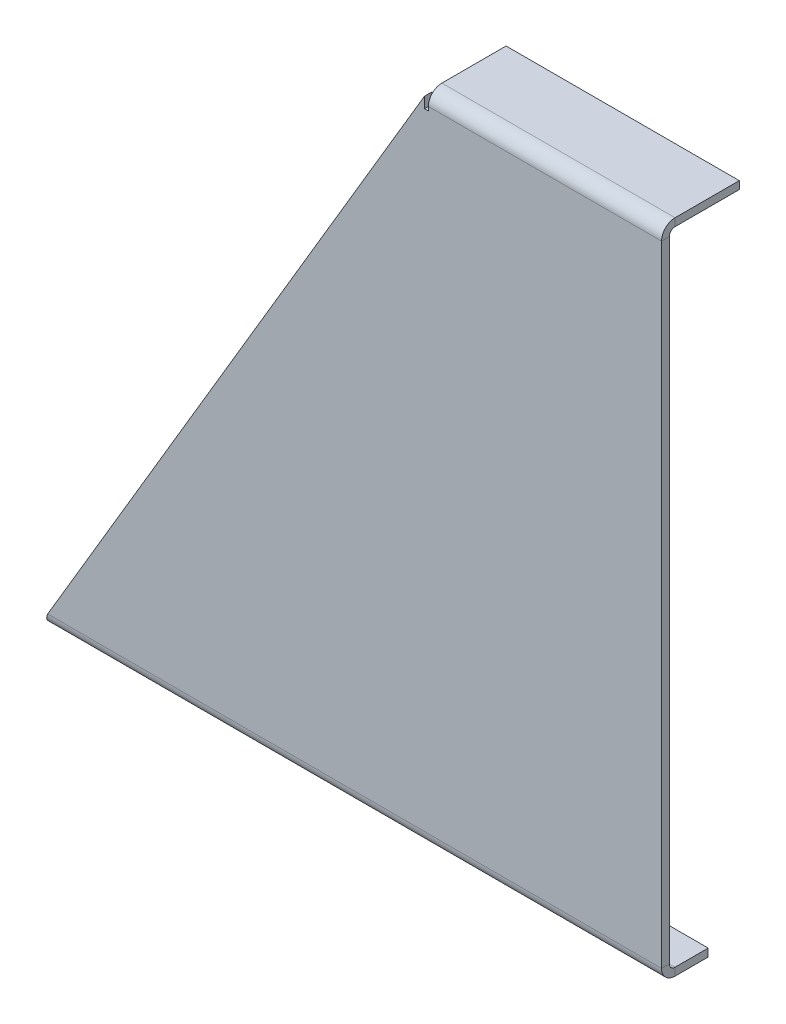
ISO-10303-21;
HEADER;
FILE_DESCRIPTION(('STEP AP214'),'2;1');
FILE_NAME('part.step','',(''),(''),'','','');
FILE_SCHEMA(('AUTOMOTIVE_DESIGN { 1 0 10303 214 1 1 1 1 }'));
ENDSEC;
DATA;
#1=APPLICATION_CONTEXT('core data for automotive mechanical design processes');
#2=APPLICATION_PROTOCOL_DEFINITION('international standard','automotive_design',2000,#1);
#3=PRODUCT_CONTEXT('',#1,'mechanical');
#4=PRODUCT('Part','Part','',(#3));
#5=PRODUCT_RELATED_PRODUCT_CATEGORY('part','',(#4));
#6=PRODUCT_DEFINITION_FORMATION('','',#4);
#7=PRODUCT_DEFINITION_CONTEXT('part definition',#1,'design');
#8=PRODUCT_DEFINITION('design','',#6,#7);
#9=PRODUCT_DEFINITION_SHAPE('','',#8);
#10=(LENGTH_UNIT() NAMED_UNIT(*) SI_UNIT(.MILLI.,.METRE.));
#11=(NAMED_UNIT(*) PLANE_ANGLE_UNIT() SI_UNIT($,.RADIAN.));
#12=(NAMED_UNIT(*) SI_UNIT($,.STERADIAN.) SOLID_ANGLE_UNIT());
#13=UNCERTAINTY_MEASURE_WITH_UNIT(LENGTH_MEASURE(1.E-05),#10,'distance_accuracy_value','');
#14=(GEOMETRIC_REPRESENTATION_CONTEXT(3) GLOBAL_UNCERTAINTY_ASSIGNED_CONTEXT((#13)) GLOBAL_UNIT_ASSIGNED_CONTEXT((#10,
#11,#12)) REPRESENTATION_CONTEXT('',''));
#15=CARTESIAN_POINT('',(0.,0.,0.));
#16=DIRECTION('',(0.,0.,1.));
#17=DIRECTION('',(1.,0.,0.));
#18=AXIS2_PLACEMENT_3D('',#15,#16,#17);
#19=CARTESIAN_POINT('',(-30.,84.5,-1.));
#20=DIRECTION('',(-0.860622231738049,0.509243924105354,0.));
#21=DIRECTION('',(-0.509243924105354,-0.860622231738049,0.));
#22=AXIS2_PLACEMENT_3D('',#19,#20,#21);
#23=PLANE('',#22);
#24=DIRECTION('',(-0.509243924105354,-0.860622231738049,0.));
#25=VECTOR('',#24,1.);
#26=CARTESIAN_POINT('',(-30.,84.5,0.));
#27=LINE('',#26,#25);
#28=CARTESIAN_POINT('',(-30.5,83.655,0.));
#29=VERTEX_POINT('',#28);
#30=CARTESIAN_POINT('',(-78.972426035503,1.7366,0.));
#31=VERTEX_POINT('',#30);
#32=EDGE_CURVE('E105',#29,#31,#27,.T.);
#33=ORIENTED_EDGE('',*,*,#32,.F.);
#34=DIRECTION('',(0.,0.,1.));
#35=VECTOR('',#34,1.);
#36=CARTESIAN_POINT('',(-30.5,83.655,-1.));
#37=LINE('',#36,#35);
#38=CARTESIAN_POINT('',(-30.5,83.655,-1.));
#39=VERTEX_POINT('',#38);
#40=EDGE_CURVE('E277',#39,#29,#37,.T.);
#41=ORIENTED_EDGE('',*,*,#40,.F.);
#42=DIRECTION('',(-0.509243924105354,-0.860622231738049,0.));
#43=VECTOR('',#42,1.);
#44=CARTESIAN_POINT('',(-30.,84.5,-1.));
#45=LINE('',#44,#43);
#46=CARTESIAN_POINT('',(-78.972426035503,1.7366,-1.));
#47=VERTEX_POINT('',#46);
#48=EDGE_CURVE('E120',#39,#47,#45,.T.);
#49=ORIENTED_EDGE('',*,*,#48,.T.);
#50=DIRECTION('',(0.,0.,1.));
#51=VECTOR('',#50,1.);
#52=CARTESIAN_POINT('',(-78.972426035503,1.7366,-1.));
#53=LINE('',#52,#51);
#54=EDGE_CURVE('E314',#47,#31,#53,.T.);
#55=ORIENTED_EDGE('',*,*,#54,.T.);
#56=EDGE_LOOP('',(#33,#41,#49,#55));
#57=FACE_BOUND('',#56,.T.);
#58=ADVANCED_FACE('F81',(#57),#23,.T.);
#59=CARTESIAN_POINT('',(0.,0.,-1.));
#60=DIRECTION('',(0.,0.,1.));
#61=DIRECTION('',(1.,0.,0.));
#62=AXIS2_PLACEMENT_3D('',#59,#60,#61);
#63=PLANE('',#62);
#64=DIRECTION('',(1.,0.,0.));
#65=VECTOR('',#64,1.);
#66=CARTESIAN_POINT('',(0.,82.7634,-1.));
#67=LINE('',#66,#65);
#68=CARTESIAN_POINT('',(0.,82.7634,-1.));
#69=VERTEX_POINT('',#68);
#70=CARTESIAN_POINT('',(-30.,82.7634,-1.));
#71=VERTEX_POINT('',#70);
#72=EDGE_CURVE('E256',#69,#71,#67,.F.);
#73=ORIENTED_EDGE('',*,*,#72,.F.);
#74=DIRECTION('',(0.,1.,0.));
#75=VECTOR('',#74,1.);
#76=CARTESIAN_POINT('',(0.,0.,-1.));
#77=LINE('',#76,#75);
#78=CARTESIAN_POINT('',(0.,1.7366,-1.));
#79=VERTEX_POINT('',#78);
#80=EDGE_CURVE('E379',#79,#69,#77,.T.);
#81=ORIENTED_EDGE('',*,*,#80,.F.);
#82=DIRECTION('',(-1.,0.,0.));
#83=VECTOR('',#82,1.);
#84=CARTESIAN_POINT('',(-80.,1.7366,-1.));
#85=LINE('',#84,#83);
#86=EDGE_CURVE('E127',#47,#79,#85,.F.);
#87=ORIENTED_EDGE('',*,*,#86,.F.);
#88=ORIENTED_EDGE('',*,*,#48,.F.);
#89=DIRECTION('',(0.,1.,0.));
#90=VECTOR('',#89,1.);
#91=CARTESIAN_POINT('',(-30.5,82.2634,-1.));
#92=LINE('',#91,#90);
#93=CARTESIAN_POINT('',(-30.5,82.2634,-1.));
#94=VERTEX_POINT('',#93);
#95=EDGE_CURVE('E275',#94,#39,#92,.T.);
#96=ORIENTED_EDGE('',*,*,#95,.F.);
#97=DIRECTION('',(-1.,0.,0.));
#98=VECTOR('',#97,1.);
#99=CARTESIAN_POINT('',(-30.,82.2634,-1.));
#100=LINE('',#99,#98);
#101=CARTESIAN_POINT('',(-30.,82.2634,-1.));
#102=VERTEX_POINT('',#101);
#103=EDGE_CURVE('E271',#102,#94,#100,.T.);
#104=ORIENTED_EDGE('',*,*,#103,.F.);
#105=DIRECTION('',(0.,-1.,0.));
#106=VECTOR('',#105,1.);
#107=CARTESIAN_POINT('',(-30.,82.7634,-1.));
#108=LINE('',#107,#106);
#109=EDGE_CURVE('E267',#71,#102,#108,.T.);
#110=ORIENTED_EDGE('',*,*,#109,.F.);
#111=EDGE_LOOP('',(#73,#81,#87,#88,#96,#104,#110));
#112=FACE_BOUND('',#111,.T.);
#113=ADVANCED_FACE('F366',(#112),#63,.F.);
#114=CARTESIAN_POINT('',(0.,0.,0.));
#115=DIRECTION('',(0.,0.,1.));
#116=DIRECTION('',(1.,0.,0.));
#117=AXIS2_PLACEMENT_3D('',#114,#115,#116);
#118=PLANE('',#117);
#119=DIRECTION('',(0.,1.,0.));
#120=VECTOR('',#119,1.);
#121=CARTESIAN_POINT('',(0.,0.,0.));
#122=LINE('',#121,#120);
#123=CARTESIAN_POINT('',(0.,1.7366,0.));
#124=VERTEX_POINT('',#123);
#125=CARTESIAN_POINT('',(0.,82.7634,0.));
#126=VERTEX_POINT('',#125);
#127=EDGE_CURVE('E323',#124,#126,#122,.T.);
#128=ORIENTED_EDGE('',*,*,#127,.T.);
#129=DIRECTION('',(1.,0.,0.));
#130=VECTOR('',#129,1.);
#131=CARTESIAN_POINT('',(0.,82.7634,0.));
#132=LINE('',#131,#130);
#133=CARTESIAN_POINT('',(-30.,82.7634,0.));
#134=VERTEX_POINT('',#133);
#135=EDGE_CURVE('E243',#126,#134,#132,.F.);
#136=ORIENTED_EDGE('',*,*,#135,.T.);
#137=DIRECTION('',(0.,-1.,0.));
#138=VECTOR('',#137,1.);
#139=CARTESIAN_POINT('',(-30.,0.,0.));
#140=LINE('',#139,#138);
#141=CARTESIAN_POINT('',(-30.,82.2634,0.));
#142=VERTEX_POINT('',#141);
#143=EDGE_CURVE('E13',#134,#142,#140,.T.);
#144=ORIENTED_EDGE('',*,*,#143,.T.);
#145=DIRECTION('',(-1.,0.,0.));
#146=VECTOR('',#145,1.);
#147=CARTESIAN_POINT('',(0.,82.2634,0.));
#148=LINE('',#147,#146);
#149=CARTESIAN_POINT('',(-30.5,82.2634,0.));
#150=VERTEX_POINT('',#149);
#151=EDGE_CURVE('E89',#142,#150,#148,.T.);
#152=ORIENTED_EDGE('',*,*,#151,.T.);
#153=DIRECTION('',(0.,1.,0.));
#154=VECTOR('',#153,1.);
#155=CARTESIAN_POINT('',(-30.5,0.,0.));
#156=LINE('',#155,#154);
#157=EDGE_CURVE('E383',#150,#29,#156,.T.);
#158=ORIENTED_EDGE('',*,*,#157,.T.);
#159=ORIENTED_EDGE('',*,*,#32,.T.);
#160=DIRECTION('',(-1.,0.,0.));
#161=VECTOR('',#160,1.);
#162=CARTESIAN_POINT('',(-80.,1.7366,0.));
#163=LINE('',#162,#161);
#164=EDGE_CURVE('E315',#31,#124,#163,.F.);
#165=ORIENTED_EDGE('',*,*,#164,.T.);
#166=EDGE_LOOP('',(#128,#136,#144,#152,#158,#159,#165));
#167=FACE_BOUND('',#166,.T.);
#168=ADVANCED_FACE('F362',(#167),#118,.T.);
#169=CARTESIAN_POINT('',(0.,0.,-1.));
#170=DIRECTION('',(1.,0.,0.));
#171=DIRECTION('',(0.,0.,-1.));
#172=AXIS2_PLACEMENT_3D('',#169,#170,#171);
#173=PLANE('',#172);
#174=ORIENTED_EDGE('',*,*,#80,.T.);
#175=DIRECTION('',(0.,0.,1.));
#176=VECTOR('',#175,1.);
#177=CARTESIAN_POINT('',(0.,82.7634,-1.));
#178=LINE('',#177,#176);
#179=EDGE_CURVE('E250',#69,#126,#178,.T.);
#180=ORIENTED_EDGE('',*,*,#179,.T.);
#181=ORIENTED_EDGE('',*,*,#127,.F.);
#182=DIRECTION('',(0.,0.,1.));
#183=VECTOR('',#182,1.);
#184=CARTESIAN_POINT('',(0.,1.7366,-1.));
#185=LINE('',#184,#183);
#186=EDGE_CURVE('E321',#79,#124,#185,.T.);
#187=ORIENTED_EDGE('',*,*,#186,.F.);
#188=EDGE_LOOP('',(#174,#180,#181,#187));
#189=FACE_BOUND('',#188,.T.);
#190=ADVANCED_FACE('F83',(#189),#173,.T.);
#191=CARTESIAN_POINT('',(0.,1.7366,-1.7366));
#192=DIRECTION('',(1.,0.,0.));
#193=DIRECTION('',(0.,0.,-1.));
#194=AXIS2_PLACEMENT_3D('',#191,#192,#193);
#195=PLANE('',#194);
#196=DIRECTION('',(0.,1.,0.));
#197=VECTOR('',#196,1.);
#198=CARTESIAN_POINT('',(0.,0.,-1.73659999999999));
#199=LINE('',#198,#197);
#200=CARTESIAN_POINT('',(0.,0.999999999999997,-1.7366));
#201=VERTEX_POINT('',#200);
#202=CARTESIAN_POINT('',(0.,0.,-1.73659999999999));
#203=VERTEX_POINT('',#202);
#204=EDGE_CURVE('E270',#201,#203,#199,.F.);
#205=ORIENTED_EDGE('',*,*,#204,.F.);
#206=CARTESIAN_POINT('',(0.,1.7366,-1.7366));
#207=DIRECTION('',(-1.,0.,0.));
#208=DIRECTION('',(0.,0.,1.));
#209=AXIS2_PLACEMENT_3D('',#206,#207,#208);
#210=CIRCLE('',#209,0.736599999999998);
#211=EDGE_CURVE('E316',#79,#201,#210,.F.);
#212=ORIENTED_EDGE('',*,*,#211,.F.);
#213=ORIENTED_EDGE('',*,*,#186,.T.);
#214=CARTESIAN_POINT('',(0.,1.7366,-1.7366));
#215=DIRECTION('',(-1.,0.,0.));
#216=DIRECTION('',(0.,0.,1.));
#217=AXIS2_PLACEMENT_3D('',#214,#215,#216);
#218=CIRCLE('',#217,1.7366);
#219=EDGE_CURVE('E96',#124,#203,#218,.F.);
#220=ORIENTED_EDGE('',*,*,#219,.T.);
#221=EDGE_LOOP('',(#205,#212,#213,#220));
#222=FACE_BOUND('',#221,.T.);
#223=ADVANCED_FACE('F354',(#222),#195,.T.);
#224=CARTESIAN_POINT('',(-80.,-0.0100000000000026,-1.73659999999999));
#225=CARTESIAN_POINT('',(-79.9143552669118,-0.0100000000000018,-1.50793444079452));
#226=CARTESIAN_POINT('',(-79.8287376725838,0.0354593229311186,-1.27943114517808));
#227=CARTESIAN_POINT('',(-79.6574753451677,0.210444694100452,-0.856979088884184));
#228=CARTESIAN_POINT('',(-79.5718441814596,0.339901893067338,-0.663232698891812));
#229=CARTESIAN_POINT('',(-79.4005818540434,0.663232698891812,-0.339901893067339));
#230=CARTESIAN_POINT('',(-79.3149506903353,0.856979088884186,-0.210444694100454));
#231=CARTESIAN_POINT('',(-79.1436883629191,1.27943114517808,-0.0354593229311214));
#232=CARTESIAN_POINT('',(-79.0580707685912,1.50793444079454,0.00999999999999834));
#233=CARTESIAN_POINT('',(-78.972426035503,1.7366,0.00999999999999827));
#234=CARTESIAN_POINT('',(-80.,0.,-1.73659999999999));
#235=CARTESIAN_POINT('',(-79.9143553158032,0.,-1.50924369946561));
#236=CARTESIAN_POINT('',(-79.8287376725838,0.0451990496978017,-1.28204862402167));
#237=CARTESIAN_POINT('',(-79.6574753451677,0.219182557983995,-0.862015278687893));
#238=CARTESIAN_POINT('',(-79.5718441814596,0.34789856149132,-0.669378166091561));
#239=CARTESIAN_POINT('',(-79.4005818540434,0.669378166091562,-0.34789856149132));
#240=CARTESIAN_POINT('',(-79.3149506903353,0.862015278687895,-0.219182557983996));
#241=CARTESIAN_POINT('',(-79.1436883629191,1.28204862402167,-0.0451990496978045));
#242=CARTESIAN_POINT('',(-79.0580707196997,1.50924369946562,0.));
#243=CARTESIAN_POINT('',(-78.972426035503,1.7366,0.));
#244=CARTESIAN_POINT('',(-80.,0.999999999999997,-1.7366));
#245=CARTESIAN_POINT('',(-79.9143602049447,0.999999999999998,-1.64016956657421));
#246=CARTESIAN_POINT('',(-79.8287376725838,1.01917172636612,-1.54379650838095));
#247=CARTESIAN_POINT('',(-79.6574753451677,1.09296894633825,-1.36563425905879));
#248=CARTESIAN_POINT('',(-79.5718441814596,1.1475654038895,-1.28392488606648));
#249=CARTESIAN_POINT('',(-79.4005818540434,1.28392488606648,-1.1475654038895));
#250=CARTESIAN_POINT('',(-79.3149506903353,1.36563425905879,-1.09296894633825));
#251=CARTESIAN_POINT('',(-79.1436883629191,1.54379650838095,-1.01917172636612));
#252=CARTESIAN_POINT('',(-79.0580658305582,1.64016956657423,-1.));
#253=CARTESIAN_POINT('',(-78.972426035503,1.7366,-1.));
#254=CARTESIAN_POINT('',(-80.,1.0101,-1.7366));
#255=CARTESIAN_POINT('',(-79.9143602543251,1.0101,-1.64149191783201));
#256=CARTESIAN_POINT('',(-79.8287376725838,1.02900885040047,-1.54644016201298));
#257=CARTESIAN_POINT('',(-79.6574753451677,1.10179418886063,-1.37072081076054));
#258=CARTESIAN_POINT('',(-79.5718441814596,1.15564203899772,-1.29013180793822));
#259=CARTESIAN_POINT('',(-79.4005818540434,1.29013180793822,-1.15564203899772));
#260=CARTESIAN_POINT('',(-79.3149506903353,1.37072081076054,-1.10179418886063));
#261=CARTESIAN_POINT('',(-79.1436883629191,1.54644016201298,-1.02900885040047));
#262=CARTESIAN_POINT('',(-79.0580657811779,1.64149191783203,-1.0101));
#263=CARTESIAN_POINT('',(-78.972426035503,1.7366,-1.0101));
#264=B_SPLINE_SURFACE_WITH_KNOTS('',1,3,((#224,#225,#226,#227,#228,#229,#230,#231,#232,#233),
(#234,#235,#236,#237,#238,#239,#240,#241,#242,#243),(#244,#245,#246,#247,#248,#249,#250,#251,
#252,#253),(#254,#255,#256,#257,#258,#259,#260,#261,#262,#263)),.UNSPECIFIED.,.F.,.F.,.F.,(2,1,
1,2),(4,2,2,2,4),(-0.01,0.,1.,1.0101),(0.,0.25,0.5,0.75,1.),.UNSPECIFIED.);
#265=CARTESIAN_POINT('',(-80.,0.999999999999997,-1.7366));
#266=CARTESIAN_POINT('',(-79.9793417341055,0.999998385524644,-1.71334069900053));
#267=CARTESIAN_POINT('',(-79.9586903644325,1.00110210067061,-1.69008769119382));
#268=CARTESIAN_POINT('',(-79.9173915013924,1.00550035484519,-1.64379295400256));
#269=CARTESIAN_POINT('',(-79.8967440079289,1.00879454721008,-1.62075119177127));
#270=CARTESIAN_POINT('',(-79.8347933045661,1.02193137077546,-1.55224139075209));
#271=CARTESIAN_POINT('',(-79.7934712546063,1.03502826813331,-1.50737666790148));
#272=CARTESIAN_POINT('',(-79.702867466678,1.0727649781611,-1.41259439094553));
#273=CARTESIAN_POINT('',(-79.6535838847331,1.0991407892047,-1.36336538717515));
#274=CARTESIAN_POINT('',(-79.5550195137946,1.16225126455375,-1.27207585196699));
#275=CARTESIAN_POINT('',(-79.505738724763,1.19898557765648,-1.23001507756954));
#276=CARTESIAN_POINT('',(-79.4071366623878,1.28098022386225,-1.15515731651736));
#277=CARTESIAN_POINT('',(-79.35781539476,1.32624857554744,-1.12236911540343));
#278=CARTESIAN_POINT('',(-79.2591654450539,1.42299000771329,-1.06778836424767));
#279=CARTESIAN_POINT('',(-79.2098367692369,1.47446129138947,-1.0459926394531));
#280=CARTESIAN_POINT('',(-79.1291585047412,1.56157267188461,-1.02022226437172));
#281=CARTESIAN_POINT('',(-79.0977869232146,1.59617182592308,-1.01265007091758));
#282=CARTESIAN_POINT('',(-79.0350908332332,1.6660425723685,-1.00253644947109));
#283=CARTESIAN_POINT('',(-79.0037663260872,1.70131305665952,-0.999987353123205));
#284=CARTESIAN_POINT('',(-78.972426035503,1.7366,-1.));
#285=B_SPLINE_CURVE_WITH_KNOTS('',3,(#265,#266,#267,#268,#269,#270,#271,#272,#273,#274,#275,
#276,#277,#278,#279,#280,#281,#282,#283,#284),.UNSPECIFIED.,.F.,.F.,(4,2,2,2,2,2,2,2,2,4),(0.,
0.0932885496764238,0.186562339070819,0.373061911987014,0.595442834713721,0.817816218571046,
1.04039959533507,1.26291865061132,1.40460810721421,1.5460810899052),.UNSPECIFIED.);
#286=CARTESIAN_POINT('',(-80.,0.999999999999997,-1.7366));
#287=VERTEX_POINT('',#286);
#288=EDGE_CURVE('E286',#287,#47,#285,.T.);
#289=DIRECTION('',(0.,1.,0.));
#290=VECTOR('',#289,1.);
#291=CARTESIAN_POINT('',(-80.,0.999999999999997,-1.7366));
#292=LINE('',#291,#290);
#293=CARTESIAN_POINT('',(-80.,0.,-1.73659999999999));
#294=VERTEX_POINT('',#293);
#295=EDGE_CURVE('E306',#287,#294,#292,.F.);
#296=CARTESIAN_POINT('',(-80.,0.,-1.73659999999999));
#297=CARTESIAN_POINT('',(-79.9803255059682,-2.88975003644096E-07,-1.68437544705093));
#298=CARTESIAN_POINT('',(-79.9606615325615,0.00235737310553484,-1.63217554856159));
#299=CARTESIAN_POINT('',(-79.9213355084056,0.0117588714281469,-1.52820211782401));
#300=CARTESIAN_POINT('',(-79.90167345761,0.0188024497898096,-1.47642856227153));
#301=CARTESIAN_POINT('',(-79.8427248992831,0.0468861210587641,-1.32247829513382));
#302=CARTESIAN_POINT('',(-79.8034094875566,0.0748793763552229,-1.22149257541537));
#303=CARTESIAN_POINT('',(-79.7247675037811,0.148530044385432,-1.02615470822364));
#304=CARTESIAN_POINT('',(-79.6854409455612,0.194200720534847,-0.931807604687133));
#305=CARTESIAN_POINT('',(-79.6067966591886,0.301715413818599,-0.752845770784391));
#306=CARTESIAN_POINT('',(-79.5674789315545,0.363555014672823,-0.668228391973585));
#307=CARTESIAN_POINT('',(-79.4888440358904,0.501397202167205,-0.511467358828933));
#308=CARTESIAN_POINT('',(-79.4495268681024,0.577398571738977,-0.439322633616331));
#309=CARTESIAN_POINT('',(-79.3708781431686,0.741150279767781,-0.309800152581452));
#310=CARTESIAN_POINT('',(-79.3315465874595,0.828905862095532,-0.252429021237167));
#311=CARTESIAN_POINT('',(-79.2528652860477,1.01331086306305,-0.1543379029255));
#312=CARTESIAN_POINT('',(-79.2135155410131,1.10996467744241,-0.113626200396693));
#313=CARTESIAN_POINT('',(-79.1348518130041,1.30893861995074,-0.0502571359827134));
#314=CARTESIAN_POINT('',(-79.0955378602488,1.41125037890678,-0.0275738323277053));
#315=CARTESIAN_POINT('',(-79.0422814475537,1.55146746956451,-0.009494670654602));
#316=CARTESIAN_POINT('',(-79.0282975749885,1.58843705778967,-0.00593274114112488));
#317=CARTESIAN_POINT('',(-79.000353222002,1.66246586145692,-0.00118845640804538));
#318=CARTESIAN_POINT('',(-78.9863927419806,1.69952481990006,-2.09054181302255E-06));
#319=CARTESIAN_POINT('',(-78.972426035503,1.7366,0.));
#320=B_SPLINE_CURVE_WITH_KNOTS('',3,(#296,#297,#298,#299,#300,#301,#302,#303,#304,#305,#306,
#307,#308,#309,#310,#311,#312,#313,#314,#315,#316,#317,#318,#319),.UNSPECIFIED.,.F.,.F.,(4,2,2,
2,2,2,2,2,2,2,2,4),(0.,0.167319926829098,0.334630646288719,0.668685394257583,1.00299127177095,
1.33720593425635,1.67139188742862,2.00572742963765,2.34022902952861,2.67424842608894,
2.79325301122686,2.91205651182608),.UNSPECIFIED.);
#321=EDGE_CURVE('E318',#294,#31,#320,.T.);
#322=ORIENTED_EDGE('',*,*,#288,.F.);
#323=ORIENTED_EDGE('',*,*,#295,.T.);
#324=ORIENTED_EDGE('',*,*,#321,.T.);
#325=ORIENTED_EDGE('',*,*,#54,.F.);
#326=EDGE_LOOP('',(#322,#323,#324,#325));
#327=FACE_BOUND('',#326,.T.);
#328=ADVANCED_FACE('F339',(#327),#264,.F.);
#329=CARTESIAN_POINT('',(-80.,1.7366,-1.7366));
#330=DIRECTION('',(-1.,0.,0.));
#331=DIRECTION('',(0.,-1.,0.));
#332=AXIS2_PLACEMENT_3D('',#329,#330,#331);
#333=CYLINDRICAL_SURFACE('',#332,1.7366);
#334=ORIENTED_EDGE('',*,*,#164,.F.);
#335=ORIENTED_EDGE('',*,*,#321,.F.);
#336=DIRECTION('',(-1.,0.,0.));
#337=VECTOR('',#336,1.);
#338=CARTESIAN_POINT('',(0.,0.,-1.73659999999999));
#339=LINE('',#338,#337);
#340=EDGE_CURVE('E304',#294,#203,#339,.F.);
#341=ORIENTED_EDGE('',*,*,#340,.T.);
#342=ORIENTED_EDGE('',*,*,#219,.F.);
#343=EDGE_LOOP('',(#334,#335,#341,#342));
#344=FACE_BOUND('',#343,.T.);
#345=ADVANCED_FACE('F345',(#344),#333,.T.);
#346=CARTESIAN_POINT('',(-80.,1.7366,-1.7366));
#347=DIRECTION('',(-1.,0.,0.));
#348=DIRECTION('',(0.,-1.,0.));
#349=AXIS2_PLACEMENT_3D('',#346,#347,#348);
#350=CYLINDRICAL_SURFACE('',#349,0.736599999999998);
#351=ORIENTED_EDGE('',*,*,#86,.T.);
#352=ORIENTED_EDGE('',*,*,#211,.T.);
#353=DIRECTION('',(-1.,0.,0.));
#354=VECTOR('',#353,1.);
#355=CARTESIAN_POINT('',(0.,0.999999999999997,-1.7366));
#356=LINE('',#355,#354);
#357=EDGE_CURVE('E309',#201,#287,#356,.T.);
#358=ORIENTED_EDGE('',*,*,#357,.T.);
#359=ORIENTED_EDGE('',*,*,#288,.T.);
#360=EDGE_LOOP('',(#351,#352,#358,#359));
#361=FACE_BOUND('',#360,.T.);
#362=ADVANCED_FACE('F349',(#361),#350,.F.);
#363=CARTESIAN_POINT('',(-80.,0.,-6.));
#364=DIRECTION('',(1.,0.,0.));
#365=DIRECTION('',(0.,0.,-1.));
#366=AXIS2_PLACEMENT_3D('',#363,#364,#365);
#367=PLANE('',#366);
#368=ORIENTED_EDGE('',*,*,#295,.F.);
#369=DIRECTION('',(0.,0.,1.));
#370=VECTOR('',#369,1.);
#371=CARTESIAN_POINT('',(-80.,0.999999999999982,-6.));
#372=LINE('',#371,#370);
#373=CARTESIAN_POINT('',(-80.,0.999999999999982,-6.));
#374=VERTEX_POINT('',#373);
#375=EDGE_CURVE('E302',#287,#374,#372,.F.);
#376=ORIENTED_EDGE('',*,*,#375,.T.);
#377=DIRECTION('',(0.,1.,0.));
#378=VECTOR('',#377,1.);
#379=CARTESIAN_POINT('',(-80.,0.,-6.));
#380=LINE('',#379,#378);
#381=CARTESIAN_POINT('',(-80.,0.,-6.));
#382=VERTEX_POINT('',#381);
#383=EDGE_CURVE('E283',#382,#374,#380,.T.);
#384=ORIENTED_EDGE('',*,*,#383,.F.);
#385=DIRECTION('',(0.,0.,-1.));
#386=VECTOR('',#385,1.);
#387=CARTESIAN_POINT('',(-80.,0.,0.));
#388=LINE('',#387,#386);
#389=EDGE_CURVE('E295',#294,#382,#388,.T.);
#390=ORIENTED_EDGE('',*,*,#389,.F.);
#391=EDGE_LOOP('',(#368,#376,#384,#390));
#392=FACE_BOUND('',#391,.T.);
#393=ADVANCED_FACE('F350',(#392),#367,.F.);
#394=CARTESIAN_POINT('',(0.,0.,-0.999999999999997));
#395=DIRECTION('',(-1.,0.,0.));
#396=DIRECTION('',(0.,0.,1.));
#397=AXIS2_PLACEMENT_3D('',#394,#395,#396);
#398=PLANE('',#397);
#399=ORIENTED_EDGE('',*,*,#204,.T.);
#400=DIRECTION('',(0.,0.,1.));
#401=VECTOR('',#400,1.);
#402=CARTESIAN_POINT('',(0.,0.,0.));
#403=LINE('',#402,#401);
#404=CARTESIAN_POINT('',(0.,0.,-6.));
#405=VERTEX_POINT('',#404);
#406=EDGE_CURVE('E290',#405,#203,#403,.T.);
#407=ORIENTED_EDGE('',*,*,#406,.F.);
#408=DIRECTION('',(0.,1.,0.));
#409=VECTOR('',#408,1.);
#410=CARTESIAN_POINT('',(0.,0.,-6.));
#411=LINE('',#410,#409);
#412=CARTESIAN_POINT('',(0.,0.999999999999982,-6.));
#413=VERTEX_POINT('',#412);
#414=EDGE_CURVE('E287',#405,#413,#411,.T.);
#415=ORIENTED_EDGE('',*,*,#414,.T.);
#416=DIRECTION('',(0.,0.,-1.));
#417=VECTOR('',#416,1.);
#418=CARTESIAN_POINT('',(0.,1.,-1.));
#419=LINE('',#418,#417);
#420=EDGE_CURVE('E297',#413,#201,#419,.F.);
#421=ORIENTED_EDGE('',*,*,#420,.T.);
#422=EDGE_LOOP('',(#399,#407,#415,#421));
#423=FACE_BOUND('',#422,.T.);
#424=ADVANCED_FACE('F408',(#423),#398,.F.);
#425=CARTESIAN_POINT('',(0.,0.,0.));
#426=DIRECTION('',(0.,1.,0.));
#427=DIRECTION('',(0.,0.,1.));
#428=AXIS2_PLACEMENT_3D('',#425,#426,#427);
#429=PLANE('',#428);
#430=ORIENTED_EDGE('',*,*,#340,.F.);
#431=ORIENTED_EDGE('',*,*,#389,.T.);
#432=DIRECTION('',(1.,0.,0.));
#433=VECTOR('',#432,1.);
#434=CARTESIAN_POINT('',(0.,0.,-6.));
#435=LINE('',#434,#433);
#436=EDGE_CURVE('E293',#382,#405,#435,.T.);
#437=ORIENTED_EDGE('',*,*,#436,.T.);
#438=ORIENTED_EDGE('',*,*,#406,.T.);
#439=EDGE_LOOP('',(#430,#431,#437,#438));
#440=FACE_BOUND('',#439,.T.);
#441=ADVANCED_FACE('F419',(#440),#429,.F.);
#442=CARTESIAN_POINT('',(0.,1.,0.));
#443=DIRECTION('',(0.,1.,0.));
#444=DIRECTION('',(0.,0.,1.));
#445=AXIS2_PLACEMENT_3D('',#442,#443,#444);
#446=PLANE('',#445);
#447=ORIENTED_EDGE('',*,*,#375,.F.);
#448=ORIENTED_EDGE('',*,*,#357,.F.);
#449=ORIENTED_EDGE('',*,*,#420,.F.);
#450=DIRECTION('',(-1.,0.,0.));
#451=VECTOR('',#450,1.);
#452=CARTESIAN_POINT('',(0.,0.999999999999982,-6.));
#453=LINE('',#452,#451);
#454=EDGE_CURVE('E300',#374,#413,#453,.F.);
#455=ORIENTED_EDGE('',*,*,#454,.F.);
#456=EDGE_LOOP('',(#447,#448,#449,#455));
#457=FACE_BOUND('',#456,.T.);
#458=ADVANCED_FACE('F405',(#457),#446,.T.);
#459=CARTESIAN_POINT('',(0.,0.,-6.));
#460=DIRECTION('',(0.,0.,1.));
#461=DIRECTION('',(0.,-1.,0.));
#462=AXIS2_PLACEMENT_3D('',#459,#460,#461);
#463=PLANE('',#462);
#464=ORIENTED_EDGE('',*,*,#454,.T.);
#465=ORIENTED_EDGE('',*,*,#414,.F.);
#466=ORIENTED_EDGE('',*,*,#436,.F.);
#467=ORIENTED_EDGE('',*,*,#383,.T.);
#468=EDGE_LOOP('',(#464,#465,#466,#467));
#469=FACE_BOUND('',#468,.T.);
#470=ADVANCED_FACE('F413',(#469),#463,.F.);
#471=CARTESIAN_POINT('',(-30.,82.7634,-1.));
#472=DIRECTION('',(-1.,0.,0.));
#473=DIRECTION('',(0.,0.,1.));
#474=AXIS2_PLACEMENT_3D('',#471,#472,#473);
#475=PLANE('',#474);
#476=ORIENTED_EDGE('',*,*,#143,.F.);
#477=DIRECTION('',(0.,0.,1.));
#478=VECTOR('',#477,1.);
#479=CARTESIAN_POINT('',(-30.,82.7634,-1.));
#480=LINE('',#479,#478);
#481=EDGE_CURVE('E261',#71,#134,#480,.T.);
#482=ORIENTED_EDGE('',*,*,#481,.F.);
#483=ORIENTED_EDGE('',*,*,#109,.T.);
#484=DIRECTION('',(0.,0.,1.));
#485=VECTOR('',#484,1.);
#486=CARTESIAN_POINT('',(-30.,82.2634,-1.));
#487=LINE('',#486,#485);
#488=EDGE_CURVE('E274',#102,#142,#487,.T.);
#489=ORIENTED_EDGE('',*,*,#488,.T.);
#490=EDGE_LOOP('',(#476,#482,#483,#489));
#491=FACE_BOUND('',#490,.T.);
#492=ADVANCED_FACE('F389',(#491),#475,.T.);
#493=CARTESIAN_POINT('',(-30.,82.2634,-1.));
#494=DIRECTION('',(0.,1.,0.));
#495=DIRECTION('',(0.,0.,1.));
#496=AXIS2_PLACEMENT_3D('',#493,#494,#495);
#497=PLANE('',#496);
#498=ORIENTED_EDGE('',*,*,#151,.F.);
#499=ORIENTED_EDGE('',*,*,#488,.F.);
#500=ORIENTED_EDGE('',*,*,#103,.T.);
#501=DIRECTION('',(0.,0.,1.));
#502=VECTOR('',#501,1.);
#503=CARTESIAN_POINT('',(-30.5,82.2634,-1.));
#504=LINE('',#503,#502);
#505=EDGE_CURVE('E264',#94,#150,#504,.T.);
#506=ORIENTED_EDGE('',*,*,#505,.T.);
#507=EDGE_LOOP('',(#498,#499,#500,#506));
#508=FACE_BOUND('',#507,.T.);
#509=ADVANCED_FACE('F387',(#508),#497,.T.);
#510=CARTESIAN_POINT('',(-30.5,82.2634,-1.));
#511=DIRECTION('',(1.,0.,0.));
#512=DIRECTION('',(0.,0.,-1.));
#513=AXIS2_PLACEMENT_3D('',#510,#511,#512);
#514=PLANE('',#513);
#515=ORIENTED_EDGE('',*,*,#157,.F.);
#516=ORIENTED_EDGE('',*,*,#505,.F.);
#517=ORIENTED_EDGE('',*,*,#95,.T.);
#518=ORIENTED_EDGE('',*,*,#40,.T.);
#519=EDGE_LOOP('',(#515,#516,#517,#518));
#520=FACE_BOUND('',#519,.T.);
#521=ADVANCED_FACE('F396',(#520),#514,.T.);
#522=CARTESIAN_POINT('',(-30.,82.7634,-1.73660000000001));
#523=DIRECTION('',(-1.,0.,0.));
#524=DIRECTION('',(0.,0.,1.));
#525=AXIS2_PLACEMENT_3D('',#522,#523,#524);
#526=PLANE('',#525);
#527=DIRECTION('',(0.,-1.,0.));
#528=VECTOR('',#527,1.);
#529=CARTESIAN_POINT('',(-30.,84.5,-1.7366));
#530=LINE('',#529,#528);
#531=CARTESIAN_POINT('',(-30.,83.5,-1.73660000000001));
#532=VERTEX_POINT('',#531);
#533=CARTESIAN_POINT('',(-30.,84.5,-1.7366));
#534=VERTEX_POINT('',#533);
#535=EDGE_CURVE('E225',#532,#534,#530,.F.);
#536=ORIENTED_EDGE('',*,*,#535,.F.);
#537=CARTESIAN_POINT('',(-30.,82.7634,-1.73660000000001));
#538=DIRECTION('',(1.,0.,0.));
#539=DIRECTION('',(0.,0.,-1.));
#540=AXIS2_PLACEMENT_3D('',#537,#538,#539);
#541=CIRCLE('',#540,0.736600000000004);
#542=EDGE_CURVE('E253',#71,#532,#541,.F.);
#543=ORIENTED_EDGE('',*,*,#542,.F.);
#544=ORIENTED_EDGE('',*,*,#481,.T.);
#545=CARTESIAN_POINT('',(-30.,82.7634,-1.73660000000001));
#546=DIRECTION('',(1.,0.,0.));
#547=DIRECTION('',(0.,0.,-1.));
#548=AXIS2_PLACEMENT_3D('',#545,#546,#547);
#549=CIRCLE('',#548,1.7366);
#550=EDGE_CURVE('E246',#134,#534,#549,.F.);
#551=ORIENTED_EDGE('',*,*,#550,.T.);
#552=EDGE_LOOP('',(#536,#543,#544,#551));
#553=FACE_BOUND('',#552,.T.);
#554=ADVANCED_FACE('F440',(#553),#526,.T.);
#555=CARTESIAN_POINT('',(0.,82.7634,-1.73660000000001));
#556=DIRECTION('',(-1.,0.,0.));
#557=DIRECTION('',(0.,0.,1.));
#558=AXIS2_PLACEMENT_3D('',#555,#556,#557);
#559=PLANE('',#558);
#560=CARTESIAN_POINT('',(0.,82.7634,-1.73660000000001));
#561=DIRECTION('',(1.,0.,0.));
#562=DIRECTION('',(0.,0.,-1.));
#563=AXIS2_PLACEMENT_3D('',#560,#561,#562);
#564=CIRCLE('',#563,0.736600000000004);
#565=CARTESIAN_POINT('',(0.,83.5,-1.73660000000001));
#566=VERTEX_POINT('',#565);
#567=EDGE_CURVE('E258',#566,#69,#564,.T.);
#568=ORIENTED_EDGE('',*,*,#567,.F.);
#569=DIRECTION('',(0.,-1.,0.));
#570=VECTOR('',#569,1.);
#571=CARTESIAN_POINT('',(0.,83.5,-1.7366));
#572=LINE('',#571,#570);
#573=CARTESIAN_POINT('',(0.,84.5,-1.7366));
#574=VERTEX_POINT('',#573);
#575=EDGE_CURVE('E237',#566,#574,#572,.F.);
#576=ORIENTED_EDGE('',*,*,#575,.T.);
#577=CARTESIAN_POINT('',(0.,82.7634,-1.73660000000001));
#578=DIRECTION('',(1.,0.,0.));
#579=DIRECTION('',(0.,0.,-1.));
#580=AXIS2_PLACEMENT_3D('',#577,#578,#579);
#581=CIRCLE('',#580,1.7366);
#582=EDGE_CURVE('E247',#574,#126,#581,.T.);
#583=ORIENTED_EDGE('',*,*,#582,.T.);
#584=ORIENTED_EDGE('',*,*,#179,.F.);
#585=EDGE_LOOP('',(#568,#576,#583,#584));
#586=FACE_BOUND('',#585,.T.);
#587=ADVANCED_FACE('F443',(#586),#559,.F.);
#588=CARTESIAN_POINT('',(0.,82.7634,-1.73660000000001));
#589=DIRECTION('',(1.,0.,0.));
#590=DIRECTION('',(0.,1.,0.));
#591=AXIS2_PLACEMENT_3D('',#588,#589,#590);
#592=CYLINDRICAL_SURFACE('',#591,1.7366);
#593=ORIENTED_EDGE('',*,*,#135,.F.);
#594=ORIENTED_EDGE('',*,*,#582,.F.);
#595=DIRECTION('',(1.,0.,0.));
#596=VECTOR('',#595,1.);
#597=CARTESIAN_POINT('',(-30.,84.5,-1.7366));
#598=LINE('',#597,#596);
#599=EDGE_CURVE('E235',#574,#534,#598,.F.);
#600=ORIENTED_EDGE('',*,*,#599,.T.);
#601=ORIENTED_EDGE('',*,*,#550,.F.);
#602=EDGE_LOOP('',(#593,#594,#600,#601));
#603=FACE_BOUND('',#602,.T.);
#604=ADVANCED_FACE('F446',(#603),#592,.T.);
#605=CARTESIAN_POINT('',(0.,82.7634,-1.73660000000001));
#606=DIRECTION('',(1.,0.,0.));
#607=DIRECTION('',(0.,1.,0.));
#608=AXIS2_PLACEMENT_3D('',#605,#606,#607);
#609=CYLINDRICAL_SURFACE('',#608,0.736600000000004);
#610=ORIENTED_EDGE('',*,*,#72,.T.);
#611=ORIENTED_EDGE('',*,*,#542,.T.);
#612=DIRECTION('',(1.,0.,0.));
#613=VECTOR('',#612,1.);
#614=CARTESIAN_POINT('',(-30.,83.5,-1.7366));
#615=LINE('',#614,#613);
#616=EDGE_CURVE('E240',#532,#566,#615,.T.);
#617=ORIENTED_EDGE('',*,*,#616,.T.);
#618=ORIENTED_EDGE('',*,*,#567,.T.);
#619=EDGE_LOOP('',(#610,#611,#617,#618));
#620=FACE_BOUND('',#619,.T.);
#621=ADVANCED_FACE('F451',(#620),#609,.F.);
#622=CARTESIAN_POINT('',(0.,84.5,-10.));
#623=DIRECTION('',(-1.,0.,0.));
#624=DIRECTION('',(0.,0.,1.));
#625=AXIS2_PLACEMENT_3D('',#622,#623,#624);
#626=PLANE('',#625);
#627=ORIENTED_EDGE('',*,*,#575,.F.);
#628=DIRECTION('',(0.,0.,1.));
#629=VECTOR('',#628,1.);
#630=CARTESIAN_POINT('',(0.,83.5,-10.));
#631=LINE('',#630,#629);
#632=CARTESIAN_POINT('',(0.,83.5,-10.));
#633=VERTEX_POINT('',#632);
#634=EDGE_CURVE('E233',#566,#633,#631,.F.);
#635=ORIENTED_EDGE('',*,*,#634,.T.);
#636=DIRECTION('',(0.,-1.,0.));
#637=VECTOR('',#636,1.);
#638=CARTESIAN_POINT('',(0.,84.5,-10.));
#639=LINE('',#638,#637);
#640=CARTESIAN_POINT('',(0.,84.5,-10.));
#641=VERTEX_POINT('',#640);
#642=EDGE_CURVE('E221',#641,#633,#639,.T.);
#643=ORIENTED_EDGE('',*,*,#642,.F.);
#644=DIRECTION('',(0.,0.,-1.));
#645=VECTOR('',#644,1.);
#646=CARTESIAN_POINT('',(0.,84.5,2.64085496841137E-13));
#647=LINE('',#646,#645);
#648=EDGE_CURVE('E208',#574,#641,#647,.T.);
#649=ORIENTED_EDGE('',*,*,#648,.F.);
#650=EDGE_LOOP('',(#627,#635,#643,#649));
#651=FACE_BOUND('',#650,.T.);
#652=ADVANCED_FACE('F454',(#651),#626,.F.);
#653=CARTESIAN_POINT('',(-30.,84.5,-0.999999999999997));
#654=DIRECTION('',(1.,0.,0.));
#655=DIRECTION('',(0.,0.,-1.));
#656=AXIS2_PLACEMENT_3D('',#653,#654,#655);
#657=PLANE('',#656);
#658=ORIENTED_EDGE('',*,*,#535,.T.);
#659=DIRECTION('',(0.,0.,1.));
#660=VECTOR('',#659,1.);
#661=CARTESIAN_POINT('',(-30.,84.5,2.64085496841137E-13));
#662=LINE('',#661,#660);
#663=CARTESIAN_POINT('',(-30.,84.5,-10.));
#664=VERTEX_POINT('',#663);
#665=EDGE_CURVE('E206',#664,#534,#662,.T.);
#666=ORIENTED_EDGE('',*,*,#665,.F.);
#667=DIRECTION('',(0.,-1.,0.));
#668=VECTOR('',#667,1.);
#669=CARTESIAN_POINT('',(-30.,84.5,-10.));
#670=LINE('',#669,#668);
#671=CARTESIAN_POINT('',(-30.,83.5,-10.));
#672=VERTEX_POINT('',#671);
#673=EDGE_CURVE('E214',#664,#672,#670,.T.);
#674=ORIENTED_EDGE('',*,*,#673,.T.);
#675=DIRECTION('',(0.,0.,-1.));
#676=VECTOR('',#675,1.);
#677=CARTESIAN_POINT('',(-30.,83.5,-1.));
#678=LINE('',#677,#676);
#679=EDGE_CURVE('E230',#672,#532,#678,.F.);
#680=ORIENTED_EDGE('',*,*,#679,.T.);
#681=EDGE_LOOP('',(#658,#666,#674,#680));
#682=FACE_BOUND('',#681,.T.);
#683=ADVANCED_FACE('F224',(#682),#657,.F.);
#684=CARTESIAN_POINT('',(0.,84.5,2.64085496841137E-13));
#685=DIRECTION('',(0.,-1.,0.));
#686=DIRECTION('',(0.,0.,-1.));
#687=AXIS2_PLACEMENT_3D('',#684,#685,#686);
#688=PLANE('',#687);
#689=ORIENTED_EDGE('',*,*,#599,.F.);
#690=ORIENTED_EDGE('',*,*,#648,.T.);
#691=DIRECTION('',(-1.,0.,0.));
#692=VECTOR('',#691,1.);
#693=CARTESIAN_POINT('',(0.,84.5,-10.));
#694=LINE('',#693,#692);
#695=EDGE_CURVE('E201',#641,#664,#694,.T.);
#696=ORIENTED_EDGE('',*,*,#695,.T.);
#697=ORIENTED_EDGE('',*,*,#665,.T.);
#698=EDGE_LOOP('',(#689,#690,#696,#697));
#699=FACE_BOUND('',#698,.T.);
#700=ADVANCED_FACE('F204',(#699),#688,.F.);
#701=CARTESIAN_POINT('',(0.,83.5,2.60594015502294E-13));
#702=DIRECTION('',(0.,-1.,0.));
#703=DIRECTION('',(0.,0.,-1.));
#704=AXIS2_PLACEMENT_3D('',#701,#702,#703);
#705=PLANE('',#704);
#706=ORIENTED_EDGE('',*,*,#634,.F.);
#707=ORIENTED_EDGE('',*,*,#616,.F.);
#708=ORIENTED_EDGE('',*,*,#679,.F.);
#709=DIRECTION('',(1.,0.,0.));
#710=VECTOR('',#709,1.);
#711=CARTESIAN_POINT('',(-30.,83.5,-10.));
#712=LINE('',#711,#710);
#713=EDGE_CURVE('E217',#633,#672,#712,.F.);
#714=ORIENTED_EDGE('',*,*,#713,.F.);
#715=EDGE_LOOP('',(#706,#707,#708,#714));
#716=FACE_BOUND('',#715,.T.);
#717=ADVANCED_FACE('F464',(#716),#705,.T.);
#718=CARTESIAN_POINT('',(-30.,84.5,-10.));
#719=DIRECTION('',(0.,0.,1.));
#720=DIRECTION('',(0.,-1.,0.));
#721=AXIS2_PLACEMENT_3D('',#718,#719,#720);
#722=PLANE('',#721);
#723=ORIENTED_EDGE('',*,*,#713,.T.);
#724=ORIENTED_EDGE('',*,*,#673,.F.);
#725=ORIENTED_EDGE('',*,*,#695,.F.);
#726=ORIENTED_EDGE('',*,*,#642,.T.);
#727=EDGE_LOOP('',(#723,#724,#725,#726));
#728=FACE_BOUND('',#727,.T.);
#729=ADVANCED_FACE('F215',(#728),#722,.F.);
#730=CLOSED_SHELL('',(#58,#113,#168,#190,#223,#328,#345,#362,#393,#424,#441,#458,#470,#492,#509,
#521,#554,#587,#604,#621,#652,#683,#700,#717,#729));
#731=MANIFOLD_SOLID_BREP('B2',#730);
#732=ADVANCED_BREP_SHAPE_REPRESENTATION('',(#18,#731),#14);
#733=SHAPE_DEFINITION_REPRESENTATION(#9,#732);
ENDSEC;
END-ISO-10303-21;
